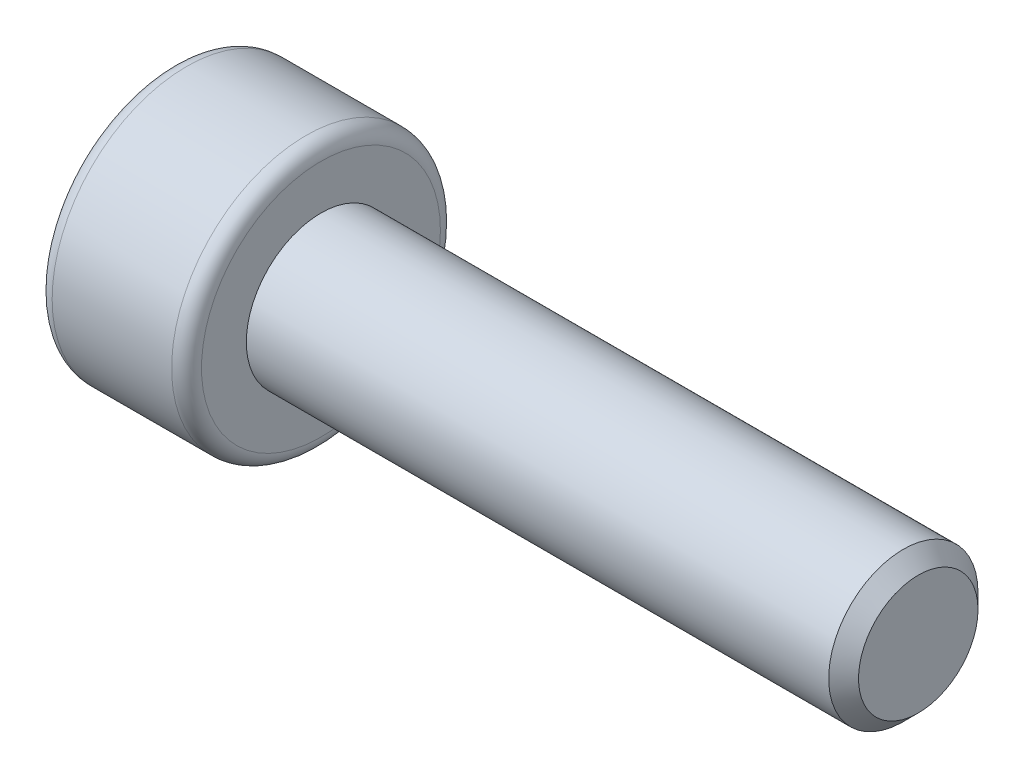
ISO-10303-21;
HEADER;
FILE_DESCRIPTION(('STEP AP214'),'2;1');
FILE_NAME('part.step','',(''),(''),'','','');
FILE_SCHEMA(('AUTOMOTIVE_DESIGN { 1 0 10303 214 1 1 1 1 }'));
ENDSEC;
DATA;
#1=APPLICATION_CONTEXT('core data for automotive mechanical design processes');
#2=APPLICATION_PROTOCOL_DEFINITION('international standard','automotive_design',2000,#1);
#3=PRODUCT_CONTEXT('',#1,'mechanical');
#4=PRODUCT('Part','Part','',(#3));
#5=PRODUCT_RELATED_PRODUCT_CATEGORY('part','',(#4));
#6=PRODUCT_DEFINITION_FORMATION('','',#4);
#7=PRODUCT_DEFINITION_CONTEXT('part definition',#1,'design');
#8=PRODUCT_DEFINITION('design','',#6,#7);
#9=PRODUCT_DEFINITION_SHAPE('','',#8);
#10=(LENGTH_UNIT() NAMED_UNIT(*) SI_UNIT(.MILLI.,.METRE.));
#11=(NAMED_UNIT(*) PLANE_ANGLE_UNIT() SI_UNIT($,.RADIAN.));
#12=(NAMED_UNIT(*) SI_UNIT($,.STERADIAN.) SOLID_ANGLE_UNIT());
#13=UNCERTAINTY_MEASURE_WITH_UNIT(LENGTH_MEASURE(1.E-05),#10,'distance_accuracy_value','');
#14=(GEOMETRIC_REPRESENTATION_CONTEXT(3) GLOBAL_UNCERTAINTY_ASSIGNED_CONTEXT((#13)) GLOBAL_UNIT_ASSIGNED_CONTEXT((#10,
#11,#12)) REPRESENTATION_CONTEXT('',''));
#15=CARTESIAN_POINT('',(0.,0.,0.));
#16=DIRECTION('',(0.,0.,1.));
#17=DIRECTION('',(1.,0.,0.));
#18=AXIS2_PLACEMENT_3D('',#15,#16,#17);
#19=CARTESIAN_POINT('',(-5.,0.,0.));
#20=DIRECTION('',(-1.,0.,0.));
#21=DIRECTION('',(0.,0.,1.));
#22=AXIS2_PLACEMENT_3D('',#19,#20,#21);
#23=PLANE('',#22);
#24=CARTESIAN_POINT('',(-5.,0.,0.));
#25=DIRECTION('',(-1.,0.,0.));
#26=DIRECTION('',(0.,0.,1.));
#27=AXIS2_PLACEMENT_3D('',#24,#25,#26);
#28=CIRCLE('',#27,1.6);
#29=CARTESIAN_POINT('',(-5.,0.,1.6));
#30=VERTEX_POINT('',#29);
#31=EDGE_CURVE('E155',#30,#30,#28,.T.);
#32=ORIENTED_EDGE('',*,*,#31,.T.);
#33=EDGE_LOOP('',(#32));
#34=FACE_BOUND('',#33,.T.);
#35=DIRECTION('',(0.,0.866025403784439,0.5));
#36=VECTOR('',#35,1.);
#37=CARTESIAN_POINT('',(-5.,-0.75,0.43301270189222));
#38=LINE('',#37,#36);
#39=CARTESIAN_POINT('',(-5.,-0.75,0.43301270189222));
#40=VERTEX_POINT('',#39);
#41=CARTESIAN_POINT('',(-5.,0.,0.866025403784439));
#42=VERTEX_POINT('',#41);
#43=EDGE_CURVE('E51',#40,#42,#38,.T.);
#44=ORIENTED_EDGE('',*,*,#43,.F.);
#45=DIRECTION('',(0.,0.,1.));
#46=VECTOR('',#45,1.);
#47=CARTESIAN_POINT('',(-5.,-0.75,-0.433012701892219));
#48=LINE('',#47,#46);
#49=CARTESIAN_POINT('',(-5.,-0.75,-0.433012701892219));
#50=VERTEX_POINT('',#49);
#51=EDGE_CURVE('E134',#50,#40,#48,.T.);
#52=ORIENTED_EDGE('',*,*,#51,.F.);
#53=DIRECTION('',(0.,-0.866025403784438,0.5));
#54=VECTOR('',#53,1.);
#55=CARTESIAN_POINT('',(-5.,0.,-0.866025403784439));
#56=LINE('',#55,#54);
#57=CARTESIAN_POINT('',(-5.,0.,-0.866025403784439));
#58=VERTEX_POINT('',#57);
#59=EDGE_CURVE('E132',#58,#50,#56,.T.);
#60=ORIENTED_EDGE('',*,*,#59,.F.);
#61=DIRECTION('',(0.,-0.866025403784438,-0.5));
#62=VECTOR('',#61,1.);
#63=CARTESIAN_POINT('',(-5.,0.75,-0.433012701892219));
#64=LINE('',#63,#62);
#65=CARTESIAN_POINT('',(-5.,0.75,-0.433012701892219));
#66=VERTEX_POINT('',#65);
#67=EDGE_CURVE('E99',#66,#58,#64,.T.);
#68=ORIENTED_EDGE('',*,*,#67,.F.);
#69=DIRECTION('',(0.,0.,-1.));
#70=VECTOR('',#69,1.);
#71=CARTESIAN_POINT('',(-5.,0.75,0.433012701892219));
#72=LINE('',#71,#70);
#73=CARTESIAN_POINT('',(-5.,0.75,0.433012701892219));
#74=VERTEX_POINT('',#73);
#75=EDGE_CURVE('E128',#74,#66,#72,.T.);
#76=ORIENTED_EDGE('',*,*,#75,.F.);
#77=DIRECTION('',(0.,0.866025403784438,-0.5));
#78=VECTOR('',#77,1.);
#79=CARTESIAN_POINT('',(-5.,0.,0.866025403784439));
#80=LINE('',#79,#78);
#81=EDGE_CURVE('E125',#42,#74,#80,.T.);
#82=ORIENTED_EDGE('',*,*,#81,.F.);
#83=EDGE_LOOP('',(#44,#52,#60,#68,#76,#82));
#84=FACE_BOUND('',#83,.T.);
#85=ADVANCED_FACE('F35',(#34,#84),#23,.T.);
#86=CARTESIAN_POINT('',(5.,0.,0.));
#87=DIRECTION('',(1.,0.,0.));
#88=DIRECTION('',(0.,0.,-1.));
#89=AXIS2_PLACEMENT_3D('',#86,#87,#88);
#90=CYLINDRICAL_SURFACE('',#89,1.8);
#91=CARTESIAN_POINT('',(-3.2,0.,0.));
#92=DIRECTION('',(1.,0.,0.));
#93=DIRECTION('',(0.,0.,-1.));
#94=AXIS2_PLACEMENT_3D('',#91,#92,#93);
#95=CIRCLE('',#94,1.8);
#96=CARTESIAN_POINT('',(-3.2,0.,-1.8));
#97=VERTEX_POINT('',#96);
#98=EDGE_CURVE('E152',#97,#97,#95,.F.);
#99=ORIENTED_EDGE('',*,*,#98,.T.);
#100=EDGE_LOOP('',(#99));
#101=FACE_BOUND('',#100,.T.);
#102=CARTESIAN_POINT('',(-4.8,0.,0.));
#103=DIRECTION('',(-1.,0.,0.));
#104=DIRECTION('',(0.,0.,1.));
#105=AXIS2_PLACEMENT_3D('',#102,#103,#104);
#106=CIRCLE('',#105,1.8);
#107=CARTESIAN_POINT('',(-4.8,0.,1.8));
#108=VERTEX_POINT('',#107);
#109=EDGE_CURVE('E149',#108,#108,#106,.F.);
#110=ORIENTED_EDGE('',*,*,#109,.T.);
#111=EDGE_LOOP('',(#110));
#112=FACE_BOUND('',#111,.T.);
#113=ADVANCED_FACE('F172',(#101,#112),#90,.T.);
#114=CARTESIAN_POINT('',(-3.,1.8,0.));
#115=DIRECTION('',(1.,0.,0.));
#116=DIRECTION('',(0.,0.,-1.));
#117=AXIS2_PLACEMENT_3D('',#114,#115,#116);
#118=PLANE('',#117);
#119=CARTESIAN_POINT('',(-3.,0.,0.));
#120=DIRECTION('',(1.,0.,0.));
#121=DIRECTION('',(0.,0.,-1.));
#122=AXIS2_PLACEMENT_3D('',#119,#120,#121);
#123=CIRCLE('',#122,1.6);
#124=CARTESIAN_POINT('',(-3.,0.,-1.6));
#125=VERTEX_POINT('',#124);
#126=EDGE_CURVE('E146',#125,#125,#123,.T.);
#127=ORIENTED_EDGE('',*,*,#126,.T.);
#128=EDGE_LOOP('',(#127));
#129=FACE_BOUND('',#128,.T.);
#130=CARTESIAN_POINT('',(-3.,0.,0.));
#131=DIRECTION('',(1.,0.,0.));
#132=DIRECTION('',(0.,0.,-1.));
#133=AXIS2_PLACEMENT_3D('',#130,#131,#132);
#134=CIRCLE('',#133,1.);
#135=CARTESIAN_POINT('',(-3.,0.,-1.));
#136=VERTEX_POINT('',#135);
#137=EDGE_CURVE('E138',#136,#136,#134,.T.);
#138=ORIENTED_EDGE('',*,*,#137,.F.);
#139=EDGE_LOOP('',(#138));
#140=FACE_BOUND('',#139,.T.);
#141=ADVANCED_FACE('F179',(#129,#140),#118,.T.);
#142=CARTESIAN_POINT('',(5.,0.,0.));
#143=DIRECTION('',(1.,0.,0.));
#144=DIRECTION('',(0.,0.,-1.));
#145=AXIS2_PLACEMENT_3D('',#142,#143,#144);
#146=CYLINDRICAL_SURFACE('',#145,1.);
#147=CARTESIAN_POINT('',(4.8,0.,0.));
#148=DIRECTION('',(1.,0.,0.));
#149=DIRECTION('',(0.,0.,-1.));
#150=AXIS2_PLACEMENT_3D('',#147,#148,#149);
#151=CIRCLE('',#150,1.);
#152=CARTESIAN_POINT('',(4.8,0.,-1.));
#153=VERTEX_POINT('',#152);
#154=EDGE_CURVE('E11',#153,#153,#151,.F.);
#155=ORIENTED_EDGE('',*,*,#154,.T.);
#156=EDGE_LOOP('',(#155));
#157=FACE_BOUND('',#156,.T.);
#158=ORIENTED_EDGE('',*,*,#137,.T.);
#159=EDGE_LOOP('',(#158));
#160=FACE_BOUND('',#159,.T.);
#161=ADVANCED_FACE('F198',(#157,#160),#146,.T.);
#162=CARTESIAN_POINT('',(5.,1.,0.));
#163=DIRECTION('',(1.,0.,0.));
#164=DIRECTION('',(0.,0.,-1.));
#165=AXIS2_PLACEMENT_3D('',#162,#163,#164);
#166=PLANE('',#165);
#167=CARTESIAN_POINT('',(5.,0.,0.));
#168=DIRECTION('',(1.,0.,0.));
#169=DIRECTION('',(0.,0.,-1.));
#170=AXIS2_PLACEMENT_3D('',#167,#168,#169);
#171=CIRCLE('',#170,0.8);
#172=CARTESIAN_POINT('',(5.,0.,-0.8));
#173=VERTEX_POINT('',#172);
#174=EDGE_CURVE('E44',#173,#173,#171,.T.);
#175=ORIENTED_EDGE('',*,*,#174,.T.);
#176=EDGE_LOOP('',(#175));
#177=FACE_BOUND('',#176,.T.);
#178=ADVANCED_FACE('F160',(#177),#166,.T.);
#179=CARTESIAN_POINT('',(-3.5,-0.75,0.43301270189222));
#180=DIRECTION('',(0.,-0.5,0.866025403784439));
#181=DIRECTION('',(0.,-0.866025403784439,-0.5));
#182=AXIS2_PLACEMENT_3D('',#179,#180,#181);
#183=PLANE('',#182);
#184=ORIENTED_EDGE('',*,*,#43,.T.);
#185=DIRECTION('',(-1.,0.,0.));
#186=VECTOR('',#185,1.);
#187=CARTESIAN_POINT('',(-3.5,0.,0.866025403784439));
#188=LINE('',#187,#186);
#189=CARTESIAN_POINT('',(-3.5,0.,0.866025403784439));
#190=VERTEX_POINT('',#189);
#191=EDGE_CURVE('E81',#190,#42,#188,.T.);
#192=ORIENTED_EDGE('',*,*,#191,.F.);
#193=DIRECTION('',(0.,0.866025403784439,0.5));
#194=VECTOR('',#193,1.);
#195=CARTESIAN_POINT('',(-3.5,-0.75,0.43301270189222));
#196=LINE('',#195,#194);
#197=CARTESIAN_POINT('',(-3.5,-0.75,0.43301270189222));
#198=VERTEX_POINT('',#197);
#199=EDGE_CURVE('E136',#198,#190,#196,.T.);
#200=ORIENTED_EDGE('',*,*,#199,.F.);
#201=DIRECTION('',(-1.,0.,0.));
#202=VECTOR('',#201,1.);
#203=CARTESIAN_POINT('',(-3.5,-0.75,0.43301270189222));
#204=LINE('',#203,#202);
#205=EDGE_CURVE('E59',#198,#40,#204,.T.);
#206=ORIENTED_EDGE('',*,*,#205,.T.);
#207=EDGE_LOOP('',(#184,#192,#200,#206));
#208=FACE_BOUND('',#207,.T.);
#209=ADVANCED_FACE('F208',(#208),#183,.F.);
#210=CARTESIAN_POINT('',(-3.5,-0.75,-0.433012701892219));
#211=DIRECTION('',(0.,-1.,0.));
#212=DIRECTION('',(0.,0.,-1.));
#213=AXIS2_PLACEMENT_3D('',#210,#211,#212);
#214=PLANE('',#213);
#215=ORIENTED_EDGE('',*,*,#51,.T.);
#216=ORIENTED_EDGE('',*,*,#205,.F.);
#217=DIRECTION('',(0.,0.,1.));
#218=VECTOR('',#217,1.);
#219=CARTESIAN_POINT('',(-3.5,-0.75,-0.433012701892219));
#220=LINE('',#219,#218);
#221=CARTESIAN_POINT('',(-3.5,-0.75,-0.433012701892219));
#222=VERTEX_POINT('',#221);
#223=EDGE_CURVE('E111',#222,#198,#220,.T.);
#224=ORIENTED_EDGE('',*,*,#223,.F.);
#225=DIRECTION('',(-1.,0.,0.));
#226=VECTOR('',#225,1.);
#227=CARTESIAN_POINT('',(-3.5,-0.75,-0.433012701892219));
#228=LINE('',#227,#226);
#229=EDGE_CURVE('E103',#222,#50,#228,.T.);
#230=ORIENTED_EDGE('',*,*,#229,.T.);
#231=EDGE_LOOP('',(#215,#216,#224,#230));
#232=FACE_BOUND('',#231,.T.);
#233=ADVANCED_FACE('F213',(#232),#214,.F.);
#234=CARTESIAN_POINT('',(-3.5,0.,-0.866025403784439));
#235=DIRECTION('',(0.,-0.5,-0.866025403784438));
#236=DIRECTION('',(0.,0.866025403784439,-0.5));
#237=AXIS2_PLACEMENT_3D('',#234,#235,#236);
#238=PLANE('',#237);
#239=ORIENTED_EDGE('',*,*,#59,.T.);
#240=ORIENTED_EDGE('',*,*,#229,.F.);
#241=DIRECTION('',(0.,-0.866025403784438,0.5));
#242=VECTOR('',#241,1.);
#243=CARTESIAN_POINT('',(-3.5,0.,-0.866025403784439));
#244=LINE('',#243,#242);
#245=CARTESIAN_POINT('',(-3.5,0.,-0.866025403784439));
#246=VERTEX_POINT('',#245);
#247=EDGE_CURVE('E107',#246,#222,#244,.T.);
#248=ORIENTED_EDGE('',*,*,#247,.F.);
#249=DIRECTION('',(-1.,0.,0.));
#250=VECTOR('',#249,1.);
#251=CARTESIAN_POINT('',(-3.5,0.,-0.866025403784439));
#252=LINE('',#251,#250);
#253=EDGE_CURVE('E92',#246,#58,#252,.T.);
#254=ORIENTED_EDGE('',*,*,#253,.T.);
#255=EDGE_LOOP('',(#239,#240,#248,#254));
#256=FACE_BOUND('',#255,.T.);
#257=ADVANCED_FACE('F108',(#256),#238,.F.);
#258=CARTESIAN_POINT('',(-3.5,0.75,-0.433012701892219));
#259=DIRECTION('',(0.,0.5,-0.866025403784439));
#260=DIRECTION('',(0.,0.866025403784439,0.5));
#261=AXIS2_PLACEMENT_3D('',#258,#259,#260);
#262=PLANE('',#261);
#263=ORIENTED_EDGE('',*,*,#67,.T.);
#264=ORIENTED_EDGE('',*,*,#253,.F.);
#265=DIRECTION('',(0.,-0.866025403784438,-0.5));
#266=VECTOR('',#265,1.);
#267=CARTESIAN_POINT('',(-3.5,0.75,-0.433012701892219));
#268=LINE('',#267,#266);
#269=CARTESIAN_POINT('',(-3.5,0.75,-0.433012701892219));
#270=VERTEX_POINT('',#269);
#271=EDGE_CURVE('E96',#270,#246,#268,.T.);
#272=ORIENTED_EDGE('',*,*,#271,.F.);
#273=DIRECTION('',(-1.,0.,0.));
#274=VECTOR('',#273,1.);
#275=CARTESIAN_POINT('',(-3.5,0.75,-0.433012701892219));
#276=LINE('',#275,#274);
#277=EDGE_CURVE('E104',#270,#66,#276,.T.);
#278=ORIENTED_EDGE('',*,*,#277,.T.);
#279=EDGE_LOOP('',(#263,#264,#272,#278));
#280=FACE_BOUND('',#279,.T.);
#281=ADVANCED_FACE('F94',(#280),#262,.F.);
#282=CARTESIAN_POINT('',(-3.5,0.75,0.433012701892219));
#283=DIRECTION('',(0.,1.,0.));
#284=DIRECTION('',(0.,0.,1.));
#285=AXIS2_PLACEMENT_3D('',#282,#283,#284);
#286=PLANE('',#285);
#287=ORIENTED_EDGE('',*,*,#75,.T.);
#288=ORIENTED_EDGE('',*,*,#277,.F.);
#289=DIRECTION('',(0.,0.,-1.));
#290=VECTOR('',#289,1.);
#291=CARTESIAN_POINT('',(-3.5,0.75,0.433012701892219));
#292=LINE('',#291,#290);
#293=CARTESIAN_POINT('',(-3.5,0.75,0.433012701892219));
#294=VERTEX_POINT('',#293);
#295=EDGE_CURVE('E117',#294,#270,#292,.T.);
#296=ORIENTED_EDGE('',*,*,#295,.F.);
#297=DIRECTION('',(-1.,0.,0.));
#298=VECTOR('',#297,1.);
#299=CARTESIAN_POINT('',(-3.5,0.75,0.433012701892219));
#300=LINE('',#299,#298);
#301=EDGE_CURVE('E141',#294,#74,#300,.T.);
#302=ORIENTED_EDGE('',*,*,#301,.T.);
#303=EDGE_LOOP('',(#287,#288,#296,#302));
#304=FACE_BOUND('',#303,.T.);
#305=ADVANCED_FACE('F216',(#304),#286,.F.);
#306=CARTESIAN_POINT('',(-3.5,0.,0.866025403784439));
#307=DIRECTION('',(0.,0.5,0.866025403784439));
#308=DIRECTION('',(0.,-0.866025403784439,0.5));
#309=AXIS2_PLACEMENT_3D('',#306,#307,#308);
#310=PLANE('',#309);
#311=ORIENTED_EDGE('',*,*,#81,.T.);
#312=ORIENTED_EDGE('',*,*,#301,.F.);
#313=DIRECTION('',(0.,0.866025403784438,-0.5));
#314=VECTOR('',#313,1.);
#315=CARTESIAN_POINT('',(-3.5,0.,0.866025403784439));
#316=LINE('',#315,#314);
#317=EDGE_CURVE('E119',#190,#294,#316,.T.);
#318=ORIENTED_EDGE('',*,*,#317,.F.);
#319=ORIENTED_EDGE('',*,*,#191,.T.);
#320=EDGE_LOOP('',(#311,#312,#318,#319));
#321=FACE_BOUND('',#320,.T.);
#322=ADVANCED_FACE('F190',(#321),#310,.F.);
#323=CARTESIAN_POINT('',(-3.5,0.,0.));
#324=DIRECTION('',(-1.,0.,0.));
#325=DIRECTION('',(0.,0.,1.));
#326=AXIS2_PLACEMENT_3D('',#323,#324,#325);
#327=PLANE('',#326);
#328=ORIENTED_EDGE('',*,*,#199,.T.);
#329=ORIENTED_EDGE('',*,*,#317,.T.);
#330=ORIENTED_EDGE('',*,*,#295,.T.);
#331=ORIENTED_EDGE('',*,*,#271,.T.);
#332=ORIENTED_EDGE('',*,*,#247,.T.);
#333=ORIENTED_EDGE('',*,*,#223,.T.);
#334=EDGE_LOOP('',(#328,#329,#330,#331,#332,#333));
#335=FACE_BOUND('',#334,.T.);
#336=ADVANCED_FACE('F114',(#335),#327,.T.);
#337=CARTESIAN_POINT('',(-3.2,0.,0.));
#338=DIRECTION('',(1.,0.,0.));
#339=DIRECTION('',(0.,0.,-1.));
#340=AXIS2_PLACEMENT_3D('',#337,#338,#339);
#341=TOROIDAL_SURFACE('',#340,1.6,0.2);
#342=ORIENTED_EDGE('',*,*,#98,.F.);
#343=EDGE_LOOP('',(#342));
#344=FACE_BOUND('',#343,.T.);
#345=ORIENTED_EDGE('',*,*,#126,.F.);
#346=EDGE_LOOP('',(#345));
#347=FACE_BOUND('',#346,.T.);
#348=ADVANCED_FACE('F168',(#344,#347),#341,.T.);
#349=CARTESIAN_POINT('',(-4.8,0.,0.));
#350=DIRECTION('',(-1.,0.,0.));
#351=DIRECTION('',(0.,0.,1.));
#352=AXIS2_PLACEMENT_3D('',#349,#350,#351);
#353=TOROIDAL_SURFACE('',#352,1.6,0.2);
#354=ORIENTED_EDGE('',*,*,#31,.F.);
#355=EDGE_LOOP('',(#354));
#356=FACE_BOUND('',#355,.T.);
#357=ORIENTED_EDGE('',*,*,#109,.F.);
#358=EDGE_LOOP('',(#357));
#359=FACE_BOUND('',#358,.T.);
#360=ADVANCED_FACE('F163',(#356,#359),#353,.T.);
#361=CARTESIAN_POINT('',(5.,0.,0.));
#362=DIRECTION('',(-1.,0.,0.));
#363=DIRECTION('',(0.,0.,1.));
#364=AXIS2_PLACEMENT_3D('',#361,#362,#363);
#365=CONICAL_SURFACE('',#364,0.8,0.785398163397448);
#366=ORIENTED_EDGE('',*,*,#154,.F.);
#367=EDGE_LOOP('',(#366));
#368=FACE_BOUND('',#367,.T.);
#369=ORIENTED_EDGE('',*,*,#174,.F.);
#370=EDGE_LOOP('',(#369));
#371=FACE_BOUND('',#370,.T.);
#372=ADVANCED_FACE('F38',(#368,#371),#365,.T.);
#373=CLOSED_SHELL('',(#85,#113,#141,#161,#178,#209,#233,#257,#281,#305,#322,#336,#348,#360,#372));
#374=MANIFOLD_SOLID_BREP('B2',#373);
#375=ADVANCED_BREP_SHAPE_REPRESENTATION('',(#18,#374),#14);
#376=SHAPE_DEFINITION_REPRESENTATION(#9,#375);
ENDSEC;
END-ISO-10303-21;
